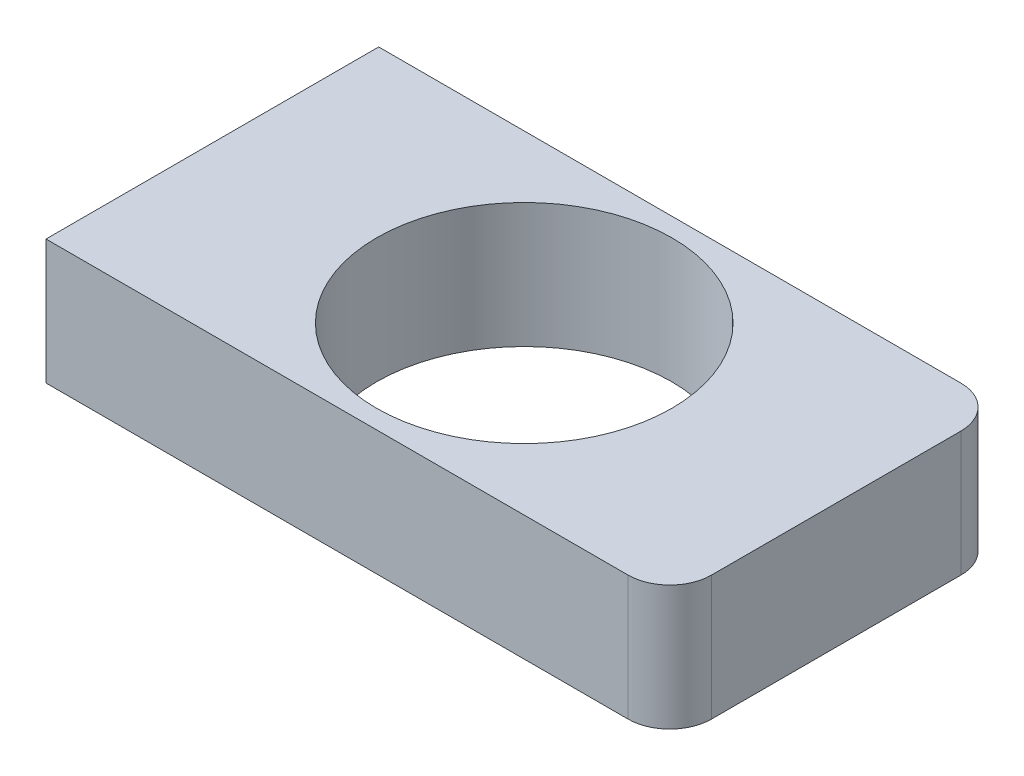
ISO-10303-21;
HEADER;
FILE_DESCRIPTION(('STEP AP214'),'2;1');
FILE_NAME('part.step','',(''),(''),'','','');
FILE_SCHEMA(('AUTOMOTIVE_DESIGN { 1 0 10303 214 1 1 1 1 }'));
ENDSEC;
DATA;
#1=APPLICATION_CONTEXT('core data for automotive mechanical design processes');
#2=APPLICATION_PROTOCOL_DEFINITION('international standard','automotive_design',2000,#1);
#3=PRODUCT_CONTEXT('',#1,'mechanical');
#4=PRODUCT('Part','Part','',(#3));
#5=PRODUCT_RELATED_PRODUCT_CATEGORY('part','',(#4));
#6=PRODUCT_DEFINITION_FORMATION('','',#4);
#7=PRODUCT_DEFINITION_CONTEXT('part definition',#1,'design');
#8=PRODUCT_DEFINITION('design','',#6,#7);
#9=PRODUCT_DEFINITION_SHAPE('','',#8);
#10=(LENGTH_UNIT() NAMED_UNIT(*) SI_UNIT(.MILLI.,.METRE.));
#11=(NAMED_UNIT(*) PLANE_ANGLE_UNIT() SI_UNIT($,.RADIAN.));
#12=(NAMED_UNIT(*) SI_UNIT($,.STERADIAN.) SOLID_ANGLE_UNIT());
#13=UNCERTAINTY_MEASURE_WITH_UNIT(LENGTH_MEASURE(1.E-05),#10,'distance_accuracy_value','');
#14=(GEOMETRIC_REPRESENTATION_CONTEXT(3) GLOBAL_UNCERTAINTY_ASSIGNED_CONTEXT((#13)) GLOBAL_UNIT_ASSIGNED_CONTEXT((#10,
#11,#12)) REPRESENTATION_CONTEXT('',''));
#15=CARTESIAN_POINT('',(0.,0.,0.));
#16=DIRECTION('',(0.,0.,1.));
#17=DIRECTION('',(1.,0.,0.));
#18=AXIS2_PLACEMENT_3D('',#15,#16,#17);
#19=CARTESIAN_POINT('',(75.,15.,-40.));
#20=DIRECTION('',(-1.,0.,0.));
#21=DIRECTION('',(0.,0.,1.));
#22=AXIS2_PLACEMENT_3D('',#19,#20,#21);
#23=PLANE('',#22);
#24=DIRECTION('',(0.,0.,-1.));
#25=VECTOR('',#24,1.);
#26=CARTESIAN_POINT('',(75.,-15.,-40.));
#27=LINE('',#26,#25);
#28=CARTESIAN_POINT('',(75.,-15.,30.));
#29=VERTEX_POINT('',#28);
#30=CARTESIAN_POINT('',(75.,-15.,-30.));
#31=VERTEX_POINT('',#30);
#32=EDGE_CURVE('E116',#29,#31,#27,.T.);
#33=ORIENTED_EDGE('',*,*,#32,.T.);
#34=DIRECTION('',(0.,-1.,0.));
#35=VECTOR('',#34,1.);
#36=CARTESIAN_POINT('',(75.,15.,-30.));
#37=LINE('',#36,#35);
#38=CARTESIAN_POINT('',(75.,15.,-30.));
#39=VERTEX_POINT('',#38);
#40=EDGE_CURVE('E54',#31,#39,#37,.F.);
#41=ORIENTED_EDGE('',*,*,#40,.T.);
#42=DIRECTION('',(0.,0.,-1.));
#43=VECTOR('',#42,1.);
#44=CARTESIAN_POINT('',(75.,15.,-40.));
#45=LINE('',#44,#43);
#46=CARTESIAN_POINT('',(75.,15.,30.));
#47=VERTEX_POINT('',#46);
#48=EDGE_CURVE('E97',#47,#39,#45,.T.);
#49=ORIENTED_EDGE('',*,*,#48,.F.);
#50=DIRECTION('',(0.,-1.,0.));
#51=VECTOR('',#50,1.);
#52=CARTESIAN_POINT('',(75.,15.,30.));
#53=LINE('',#52,#51);
#54=EDGE_CURVE('E130',#47,#29,#53,.T.);
#55=ORIENTED_EDGE('',*,*,#54,.T.);
#56=EDGE_LOOP('',(#33,#41,#49,#55));
#57=FACE_BOUND('',#56,.T.);
#58=ADVANCED_FACE('F33',(#57),#23,.F.);
#59=CARTESIAN_POINT('',(-75.,15.,-40.));
#60=DIRECTION('',(0.,0.,1.));
#61=DIRECTION('',(1.,0.,0.));
#62=AXIS2_PLACEMENT_3D('',#59,#60,#61);
#63=PLANE('',#62);
#64=DIRECTION('',(-1.,0.,0.));
#65=VECTOR('',#64,1.);
#66=CARTESIAN_POINT('',(-75.,15.,-40.));
#67=LINE('',#66,#65);
#68=CARTESIAN_POINT('',(65.,15.,-40.));
#69=VERTEX_POINT('',#68);
#70=CARTESIAN_POINT('',(-75.,15.,-40.));
#71=VERTEX_POINT('',#70);
#72=EDGE_CURVE('E87',#69,#71,#67,.T.);
#73=ORIENTED_EDGE('',*,*,#72,.F.);
#74=DIRECTION('',(0.,-1.,0.));
#75=VECTOR('',#74,1.);
#76=CARTESIAN_POINT('',(65.,15.,-40.));
#77=LINE('',#76,#75);
#78=CARTESIAN_POINT('',(65.,-15.,-40.));
#79=VERTEX_POINT('',#78);
#80=EDGE_CURVE('E106',#69,#79,#77,.T.);
#81=ORIENTED_EDGE('',*,*,#80,.T.);
#82=DIRECTION('',(-1.,0.,0.));
#83=VECTOR('',#82,1.);
#84=CARTESIAN_POINT('',(-75.,-15.,-40.));
#85=LINE('',#84,#83);
#86=CARTESIAN_POINT('',(-75.,-15.,-40.));
#87=VERTEX_POINT('',#86);
#88=EDGE_CURVE('E103',#79,#87,#85,.T.);
#89=ORIENTED_EDGE('',*,*,#88,.T.);
#90=DIRECTION('',(0.,-1.,0.));
#91=VECTOR('',#90,1.);
#92=CARTESIAN_POINT('',(-75.,15.,-40.));
#93=LINE('',#92,#91);
#94=EDGE_CURVE('E100',#71,#87,#93,.T.);
#95=ORIENTED_EDGE('',*,*,#94,.F.);
#96=EDGE_LOOP('',(#73,#81,#89,#95));
#97=FACE_BOUND('',#96,.T.);
#98=ADVANCED_FACE('F101',(#97),#63,.F.);
#99=CARTESIAN_POINT('',(-75.,15.,-40.));
#100=DIRECTION('',(1.,0.,0.));
#101=DIRECTION('',(0.,0.,-1.));
#102=AXIS2_PLACEMENT_3D('',#99,#100,#101);
#103=PLANE('',#102);
#104=DIRECTION('',(0.,0.,1.));
#105=VECTOR('',#104,1.);
#106=CARTESIAN_POINT('',(-75.,-15.,-40.));
#107=LINE('',#106,#105);
#108=CARTESIAN_POINT('',(-75.,-15.,40.));
#109=VERTEX_POINT('',#108);
#110=EDGE_CURVE('E120',#87,#109,#107,.T.);
#111=ORIENTED_EDGE('',*,*,#110,.T.);
#112=DIRECTION('',(0.,-1.,0.));
#113=VECTOR('',#112,1.);
#114=CARTESIAN_POINT('',(-75.,15.,40.));
#115=LINE('',#114,#113);
#116=CARTESIAN_POINT('',(-75.,15.,40.));
#117=VERTEX_POINT('',#116);
#118=EDGE_CURVE('E107',#117,#109,#115,.T.);
#119=ORIENTED_EDGE('',*,*,#118,.F.);
#120=DIRECTION('',(0.,0.,1.));
#121=VECTOR('',#120,1.);
#122=CARTESIAN_POINT('',(-75.,15.,-40.));
#123=LINE('',#122,#121);
#124=EDGE_CURVE('E91',#71,#117,#123,.T.);
#125=ORIENTED_EDGE('',*,*,#124,.F.);
#126=ORIENTED_EDGE('',*,*,#94,.T.);
#127=EDGE_LOOP('',(#111,#119,#125,#126));
#128=FACE_BOUND('',#127,.T.);
#129=ADVANCED_FACE('F109',(#128),#103,.F.);
#130=CARTESIAN_POINT('',(-75.,15.,40.));
#131=DIRECTION('',(0.,0.,-1.));
#132=DIRECTION('',(-1.,0.,0.));
#133=AXIS2_PLACEMENT_3D('',#130,#131,#132);
#134=PLANE('',#133);
#135=DIRECTION('',(1.,0.,0.));
#136=VECTOR('',#135,1.);
#137=CARTESIAN_POINT('',(-75.,-15.,40.));
#138=LINE('',#137,#136);
#139=CARTESIAN_POINT('',(65.,-15.,40.));
#140=VERTEX_POINT('',#139);
#141=EDGE_CURVE('E122',#109,#140,#138,.T.);
#142=ORIENTED_EDGE('',*,*,#141,.T.);
#143=DIRECTION('',(0.,-1.,0.));
#144=VECTOR('',#143,1.);
#145=CARTESIAN_POINT('',(65.,15.,40.));
#146=LINE('',#145,#144);
#147=CARTESIAN_POINT('',(65.,15.,40.));
#148=VERTEX_POINT('',#147);
#149=EDGE_CURVE('E11',#140,#148,#146,.F.);
#150=ORIENTED_EDGE('',*,*,#149,.T.);
#151=DIRECTION('',(1.,0.,0.));
#152=VECTOR('',#151,1.);
#153=CARTESIAN_POINT('',(-75.,15.,40.));
#154=LINE('',#153,#152);
#155=EDGE_CURVE('E111',#117,#148,#154,.T.);
#156=ORIENTED_EDGE('',*,*,#155,.F.);
#157=ORIENTED_EDGE('',*,*,#118,.T.);
#158=EDGE_LOOP('',(#142,#150,#156,#157));
#159=FACE_BOUND('',#158,.T.);
#160=ADVANCED_FACE('F142',(#159),#134,.F.);
#161=CARTESIAN_POINT('',(0.,15.,0.));
#162=DIRECTION('',(0.,1.,0.));
#163=DIRECTION('',(0.,0.,1.));
#164=AXIS2_PLACEMENT_3D('',#161,#162,#163);
#165=PLANE('',#164);
#166=CARTESIAN_POINT('',(0.,15.,0.));
#167=DIRECTION('',(0.,1.,0.));
#168=DIRECTION('',(0.,0.,1.));
#169=AXIS2_PLACEMENT_3D('',#166,#167,#168);
#170=CIRCLE('',#169,35.5083502917041);
#171=CARTESIAN_POINT('',(0.,15.,35.5083502917041));
#172=VERTEX_POINT('',#171);
#173=EDGE_CURVE('E178',#172,#172,#170,.T.);
#174=ORIENTED_EDGE('',*,*,#173,.F.);
#175=EDGE_LOOP('',(#174));
#176=FACE_BOUND('',#175,.T.);
#177=ORIENTED_EDGE('',*,*,#48,.T.);
#178=CARTESIAN_POINT('',(65.,15.,-30.));
#179=DIRECTION('',(0.,1.,0.));
#180=DIRECTION('',(0.,0.,1.));
#181=AXIS2_PLACEMENT_3D('',#178,#179,#180);
#182=CIRCLE('',#181,10.);
#183=EDGE_CURVE('E41',#39,#69,#182,.T.);
#184=ORIENTED_EDGE('',*,*,#183,.T.);
#185=ORIENTED_EDGE('',*,*,#72,.T.);
#186=ORIENTED_EDGE('',*,*,#124,.T.);
#187=ORIENTED_EDGE('',*,*,#155,.T.);
#188=CARTESIAN_POINT('',(65.,15.,30.));
#189=DIRECTION('',(0.,1.,0.));
#190=DIRECTION('',(0.,0.,1.));
#191=AXIS2_PLACEMENT_3D('',#188,#189,#190);
#192=CIRCLE('',#191,10.);
#193=EDGE_CURVE('E134',#148,#47,#192,.T.);
#194=ORIENTED_EDGE('',*,*,#193,.T.);
#195=EDGE_LOOP('',(#177,#184,#185,#186,#187,#194));
#196=FACE_BOUND('',#195,.T.);
#197=ADVANCED_FACE('F89',(#176,#196),#165,.T.);
#198=CARTESIAN_POINT('',(0.,-15.,0.));
#199=DIRECTION('',(0.,1.,0.));
#200=DIRECTION('',(0.,0.,1.));
#201=AXIS2_PLACEMENT_3D('',#198,#199,#200);
#202=PLANE('',#201);
#203=CARTESIAN_POINT('',(0.,-15.,0.));
#204=DIRECTION('',(0.,1.,0.));
#205=DIRECTION('',(0.,0.,1.));
#206=AXIS2_PLACEMENT_3D('',#203,#204,#205);
#207=CIRCLE('',#206,35.5083502917041);
#208=CARTESIAN_POINT('',(0.,-15.,35.5083502917041));
#209=VERTEX_POINT('',#208);
#210=EDGE_CURVE('E118',#209,#209,#207,.T.);
#211=ORIENTED_EDGE('',*,*,#210,.T.);
#212=EDGE_LOOP('',(#211));
#213=FACE_BOUND('',#212,.T.);
#214=ORIENTED_EDGE('',*,*,#88,.F.);
#215=CARTESIAN_POINT('',(65.,-15.,-30.));
#216=DIRECTION('',(0.,1.,0.));
#217=DIRECTION('',(0.,0.,1.));
#218=AXIS2_PLACEMENT_3D('',#215,#216,#217);
#219=CIRCLE('',#218,10.);
#220=EDGE_CURVE('E128',#79,#31,#219,.F.);
#221=ORIENTED_EDGE('',*,*,#220,.T.);
#222=ORIENTED_EDGE('',*,*,#32,.F.);
#223=CARTESIAN_POINT('',(65.,-15.,30.));
#224=DIRECTION('',(0.,1.,0.));
#225=DIRECTION('',(0.,0.,1.));
#226=AXIS2_PLACEMENT_3D('',#223,#224,#225);
#227=CIRCLE('',#226,10.);
#228=EDGE_CURVE('E126',#29,#140,#227,.F.);
#229=ORIENTED_EDGE('',*,*,#228,.T.);
#230=ORIENTED_EDGE('',*,*,#141,.F.);
#231=ORIENTED_EDGE('',*,*,#110,.F.);
#232=EDGE_LOOP('',(#214,#221,#222,#229,#230,#231));
#233=FACE_BOUND('',#232,.T.);
#234=ADVANCED_FACE('F141',(#213,#233),#202,.F.);
#235=CARTESIAN_POINT('',(0.,-15.,0.));
#236=DIRECTION('',(0.,1.,0.));
#237=DIRECTION('',(0.,0.,1.));
#238=AXIS2_PLACEMENT_3D('',#235,#236,#237);
#239=CYLINDRICAL_SURFACE('',#238,35.5083502917041);
#240=ORIENTED_EDGE('',*,*,#210,.F.);
#241=EDGE_LOOP('',(#240));
#242=FACE_BOUND('',#241,.T.);
#243=ORIENTED_EDGE('',*,*,#173,.T.);
#244=EDGE_LOOP('',(#243));
#245=FACE_BOUND('',#244,.T.);
#246=ADVANCED_FACE('F161',(#242,#245),#239,.F.);
#247=CARTESIAN_POINT('',(65.,15.,-30.));
#248=DIRECTION('',(0.,-1.,0.));
#249=DIRECTION('',(0.,0.,-1.));
#250=AXIS2_PLACEMENT_3D('',#247,#248,#249);
#251=CYLINDRICAL_SURFACE('',#250,10.);
#252=ORIENTED_EDGE('',*,*,#183,.F.);
#253=ORIENTED_EDGE('',*,*,#40,.F.);
#254=ORIENTED_EDGE('',*,*,#220,.F.);
#255=ORIENTED_EDGE('',*,*,#80,.F.);
#256=EDGE_LOOP('',(#252,#253,#254,#255));
#257=FACE_BOUND('',#256,.T.);
#258=ADVANCED_FACE('F159',(#257),#251,.T.);
#259=CARTESIAN_POINT('',(65.,15.,30.));
#260=DIRECTION('',(0.,-1.,0.));
#261=DIRECTION('',(0.,0.,-1.));
#262=AXIS2_PLACEMENT_3D('',#259,#260,#261);
#263=CYLINDRICAL_SURFACE('',#262,10.);
#264=ORIENTED_EDGE('',*,*,#193,.F.);
#265=ORIENTED_EDGE('',*,*,#149,.F.);
#266=ORIENTED_EDGE('',*,*,#228,.F.);
#267=ORIENTED_EDGE('',*,*,#54,.F.);
#268=EDGE_LOOP('',(#264,#265,#266,#267));
#269=FACE_BOUND('',#268,.T.);
#270=ADVANCED_FACE('F35',(#269),#263,.T.);
#271=CLOSED_SHELL('',(#58,#98,#129,#160,#197,#234,#246,#258,#270));
#272=MANIFOLD_SOLID_BREP('B2',#271);
#273=ADVANCED_BREP_SHAPE_REPRESENTATION('',(#18,#272),#14);
#274=SHAPE_DEFINITION_REPRESENTATION(#9,#273);
ENDSEC;
END-ISO-10303-21;
